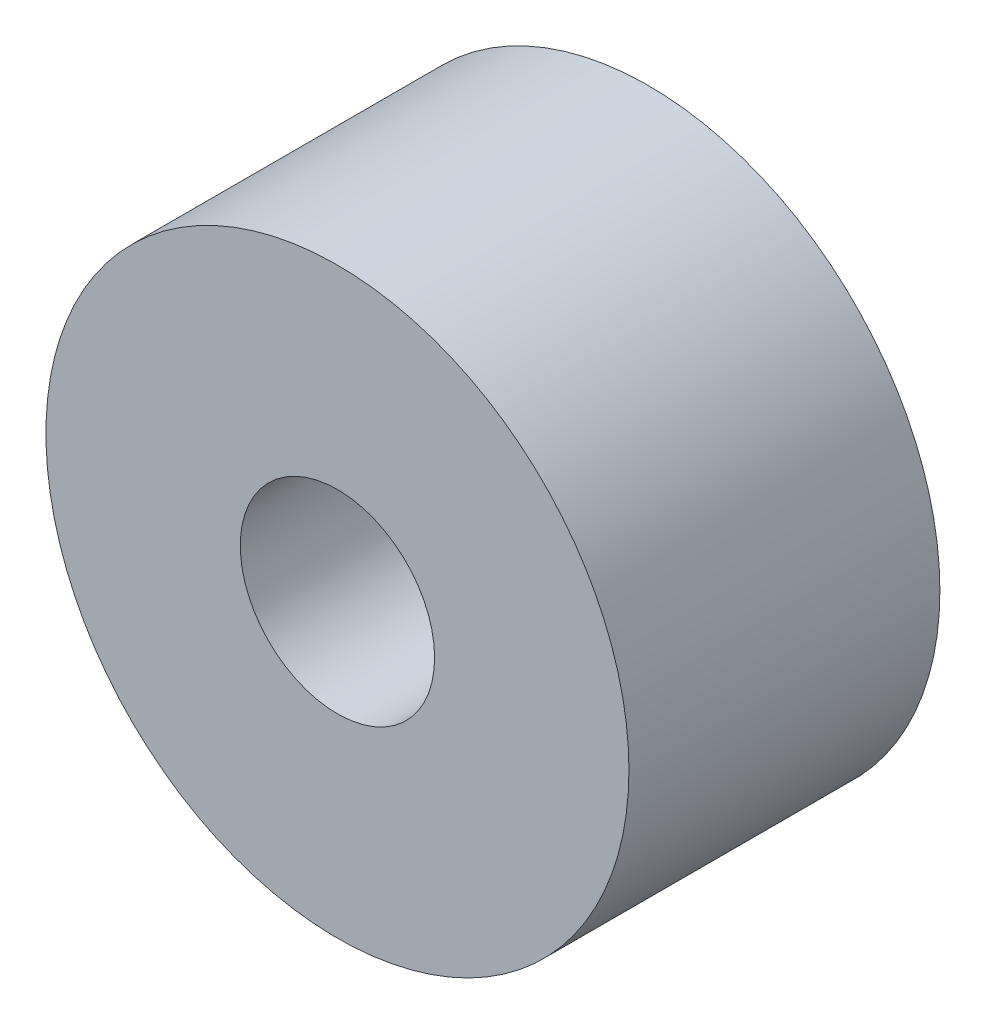
ISO-10303-21;
HEADER;
FILE_DESCRIPTION(('STEP AP214'),'2;1');
FILE_NAME('part.step','',(''),(''),'','','');
FILE_SCHEMA(('AUTOMOTIVE_DESIGN { 1 0 10303 214 1 1 1 1 }'));
ENDSEC;
DATA;
#1=APPLICATION_CONTEXT('core data for automotive mechanical design processes');
#2=APPLICATION_PROTOCOL_DEFINITION('international standard','automotive_design',2000,#1);
#3=PRODUCT_CONTEXT('',#1,'mechanical');
#4=PRODUCT('Part','Part','',(#3));
#5=PRODUCT_RELATED_PRODUCT_CATEGORY('part','',(#4));
#6=PRODUCT_DEFINITION_FORMATION('','',#4);
#7=PRODUCT_DEFINITION_CONTEXT('part definition',#1,'design');
#8=PRODUCT_DEFINITION('design','',#6,#7);
#9=PRODUCT_DEFINITION_SHAPE('','',#8);
#10=(LENGTH_UNIT() NAMED_UNIT(*) SI_UNIT(.MILLI.,.METRE.));
#11=(NAMED_UNIT(*) PLANE_ANGLE_UNIT() SI_UNIT($,.RADIAN.));
#12=(NAMED_UNIT(*) SI_UNIT($,.STERADIAN.) SOLID_ANGLE_UNIT());
#13=UNCERTAINTY_MEASURE_WITH_UNIT(LENGTH_MEASURE(1.E-05),#10,'distance_accuracy_value','');
#14=(GEOMETRIC_REPRESENTATION_CONTEXT(3) GLOBAL_UNCERTAINTY_ASSIGNED_CONTEXT((#13)) GLOBAL_UNIT_ASSIGNED_CONTEXT((#10,
#11,#12)) REPRESENTATION_CONTEXT('',''));
#15=CARTESIAN_POINT('',(0.,0.,0.));
#16=DIRECTION('',(0.,0.,1.));
#17=DIRECTION('',(1.,0.,0.));
#18=AXIS2_PLACEMENT_3D('',#15,#16,#17);
#19=CARTESIAN_POINT('',(0.,0.,16.));
#20=DIRECTION('',(0.,0.,-1.));
#21=DIRECTION('',(-1.,0.,0.));
#22=AXIS2_PLACEMENT_3D('',#19,#20,#21);
#23=CYLINDRICAL_SURFACE('',#22,15.);
#24=CARTESIAN_POINT('',(0.,0.,16.));
#25=DIRECTION('',(0.,0.,1.));
#26=DIRECTION('',(1.,0.,0.));
#27=AXIS2_PLACEMENT_3D('',#24,#25,#26);
#28=CIRCLE('',#27,15.);
#29=CARTESIAN_POINT('',(15.,0.,16.));
#30=VERTEX_POINT('',#29);
#31=EDGE_CURVE('E10',#30,#30,#28,.T.);
#32=ORIENTED_EDGE('',*,*,#31,.F.);
#33=EDGE_LOOP('',(#32));
#34=FACE_BOUND('',#33,.T.);
#35=CARTESIAN_POINT('',(0.,0.,0.));
#36=DIRECTION('',(0.,0.,1.));
#37=DIRECTION('',(1.,0.,0.));
#38=AXIS2_PLACEMENT_3D('',#35,#36,#37);
#39=CIRCLE('',#38,15.);
#40=CARTESIAN_POINT('',(15.,0.,0.));
#41=VERTEX_POINT('',#40);
#42=EDGE_CURVE('E34',#41,#41,#39,.T.);
#43=ORIENTED_EDGE('',*,*,#42,.T.);
#44=EDGE_LOOP('',(#43));
#45=FACE_BOUND('',#44,.T.);
#46=ADVANCED_FACE('F31',(#34,#45),#23,.T.);
#47=CARTESIAN_POINT('',(0.,0.,16.));
#48=DIRECTION('',(0.,0.,1.));
#49=DIRECTION('',(1.,0.,0.));
#50=AXIS2_PLACEMENT_3D('',#47,#48,#49);
#51=PLANE('',#50);
#52=CARTESIAN_POINT('',(0.,0.,16.));
#53=DIRECTION('',(0.,0.,1.));
#54=DIRECTION('',(1.,0.,0.));
#55=AXIS2_PLACEMENT_3D('',#52,#53,#54);
#56=CIRCLE('',#55,5.);
#57=CARTESIAN_POINT('',(5.,0.,16.));
#58=VERTEX_POINT('',#57);
#59=EDGE_CURVE('E43',#58,#58,#56,.T.);
#60=ORIENTED_EDGE('',*,*,#59,.F.);
#61=EDGE_LOOP('',(#60));
#62=FACE_BOUND('',#61,.T.);
#63=ORIENTED_EDGE('',*,*,#31,.T.);
#64=EDGE_LOOP('',(#63));
#65=FACE_BOUND('',#64,.T.);
#66=ADVANCED_FACE('F58',(#62,#65),#51,.T.);
#67=CARTESIAN_POINT('',(0.,0.,0.));
#68=DIRECTION('',(0.,0.,1.));
#69=DIRECTION('',(1.,0.,0.));
#70=AXIS2_PLACEMENT_3D('',#67,#68,#69);
#71=PLANE('',#70);
#72=CARTESIAN_POINT('',(0.,0.,0.));
#73=DIRECTION('',(0.,0.,1.));
#74=DIRECTION('',(1.,0.,0.));
#75=AXIS2_PLACEMENT_3D('',#72,#73,#74);
#76=CIRCLE('',#75,5.);
#77=CARTESIAN_POINT('',(5.,0.,0.));
#78=VERTEX_POINT('',#77);
#79=EDGE_CURVE('E41',#78,#78,#76,.T.);
#80=ORIENTED_EDGE('',*,*,#79,.T.);
#81=EDGE_LOOP('',(#80));
#82=FACE_BOUND('',#81,.T.);
#83=ORIENTED_EDGE('',*,*,#42,.F.);
#84=EDGE_LOOP('',(#83));
#85=FACE_BOUND('',#84,.T.);
#86=ADVANCED_FACE('F49',(#82,#85),#71,.F.);
#87=CARTESIAN_POINT('',(0.,0.,0.));
#88=DIRECTION('',(0.,0.,1.));
#89=DIRECTION('',(1.,0.,0.));
#90=AXIS2_PLACEMENT_3D('',#87,#88,#89);
#91=CYLINDRICAL_SURFACE('',#90,5.);
#92=ORIENTED_EDGE('',*,*,#79,.F.);
#93=EDGE_LOOP('',(#92));
#94=FACE_BOUND('',#93,.T.);
#95=ORIENTED_EDGE('',*,*,#59,.T.);
#96=EDGE_LOOP('',(#95));
#97=FACE_BOUND('',#96,.T.);
#98=ADVANCED_FACE('F52',(#94,#97),#91,.F.);
#99=CLOSED_SHELL('',(#46,#66,#86,#98));
#100=MANIFOLD_SOLID_BREP('B2',#99);
#101=ADVANCED_BREP_SHAPE_REPRESENTATION('',(#18,#100),#14);
#102=SHAPE_DEFINITION_REPRESENTATION(#9,#101);
ENDSEC;
END-ISO-10303-21;
